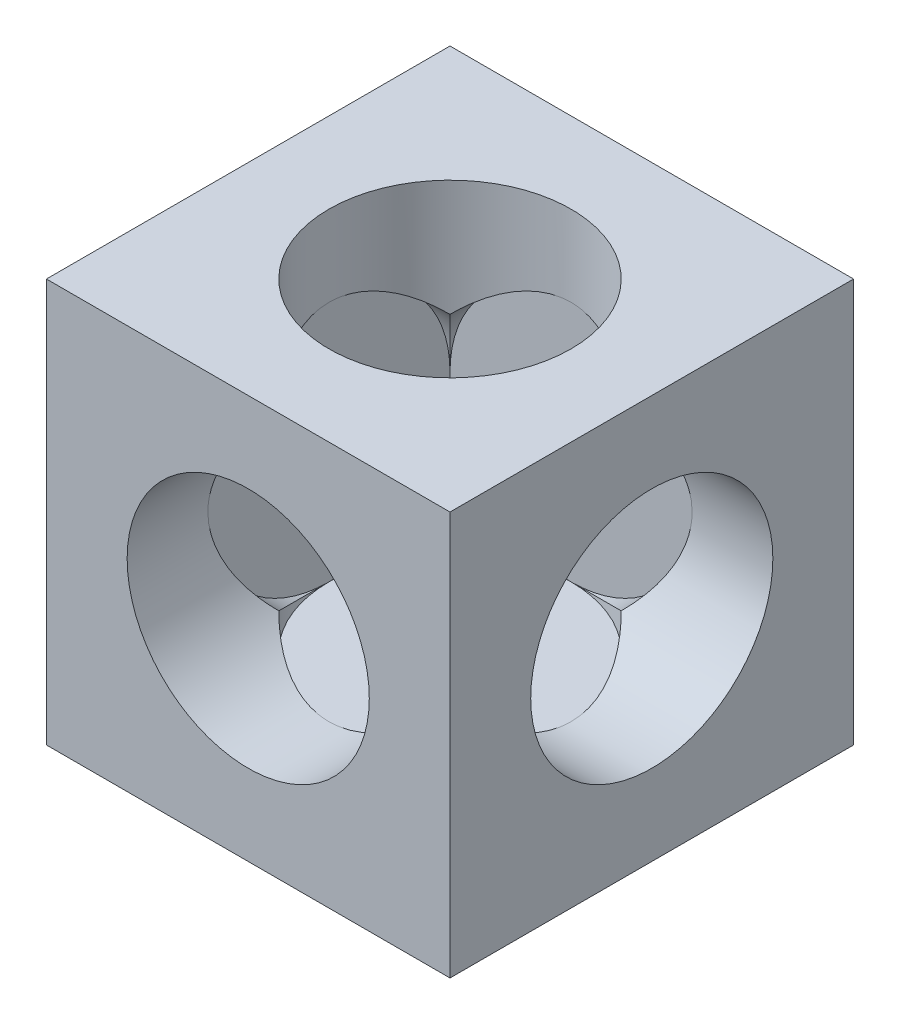
ISO-10303-21;
HEADER;
FILE_DESCRIPTION(('STEP AP214'),'2;1');
FILE_NAME('part.step','',(''),(''),'','','');
FILE_SCHEMA(('AUTOMOTIVE_DESIGN { 1 0 10303 214 1 1 1 1 }'));
ENDSEC;
DATA;
#1=APPLICATION_CONTEXT('core data for automotive mechanical design processes');
#2=APPLICATION_PROTOCOL_DEFINITION('international standard','automotive_design',2000,#1);
#3=PRODUCT_CONTEXT('',#1,'mechanical');
#4=PRODUCT('Part','Part','',(#3));
#5=PRODUCT_RELATED_PRODUCT_CATEGORY('part','',(#4));
#6=PRODUCT_DEFINITION_FORMATION('','',#4);
#7=PRODUCT_DEFINITION_CONTEXT('part definition',#1,'design');
#8=PRODUCT_DEFINITION('design','',#6,#7);
#9=PRODUCT_DEFINITION_SHAPE('','',#8);
#10=(LENGTH_UNIT() NAMED_UNIT(*) SI_UNIT(.MILLI.,.METRE.));
#11=(NAMED_UNIT(*) PLANE_ANGLE_UNIT() SI_UNIT($,.RADIAN.));
#12=(NAMED_UNIT(*) SI_UNIT($,.STERADIAN.) SOLID_ANGLE_UNIT());
#13=UNCERTAINTY_MEASURE_WITH_UNIT(LENGTH_MEASURE(1.E-05),#10,'distance_accuracy_value','');
#14=(GEOMETRIC_REPRESENTATION_CONTEXT(3) GLOBAL_UNCERTAINTY_ASSIGNED_CONTEXT((#13)) GLOBAL_UNIT_ASSIGNED_CONTEXT((#10,
#11,#12)) REPRESENTATION_CONTEXT('',''));
#15=CARTESIAN_POINT('',(0.,0.,0.));
#16=DIRECTION('',(0.,0.,1.));
#17=DIRECTION('',(1.,0.,0.));
#18=AXIS2_PLACEMENT_3D('',#15,#16,#17);
#19=CARTESIAN_POINT('',(0.,0.,2.));
#20=DIRECTION('',(0.,0.,1.));
#21=DIRECTION('',(1.,0.,0.));
#22=AXIS2_PLACEMENT_3D('',#19,#20,#21);
#23=CYLINDRICAL_SURFACE('',#22,3.);
#24=CARTESIAN_POINT('',(0.,0.,2.));
#25=DIRECTION('',(0.,0.,1.));
#26=DIRECTION('',(1.,0.,0.));
#27=AXIS2_PLACEMENT_3D('',#24,#25,#26);
#28=CIRCLE('',#27,3.);
#29=CARTESIAN_POINT('',(0.,-3.,2.));
#30=VERTEX_POINT('',#29);
#31=CARTESIAN_POINT('',(3.,0.,2.));
#32=VERTEX_POINT('',#31);
#33=EDGE_CURVE('E187',#30,#32,#28,.T.);
#34=ORIENTED_EDGE('',*,*,#33,.F.);
#35=CARTESIAN_POINT('',(0.,0.,5.));
#36=DIRECTION('',(0.,-0.707106781186547,0.707106781186547));
#37=DIRECTION('',(0.,0.707106781186547,0.707106781186547));
#38=AXIS2_PLACEMENT_3D('',#35,#36,#37);
#39=ELLIPSE('',#38,4.24264068711928,3.);
#40=CARTESIAN_POINT('',(2.12132034355964,-2.12132034355964,2.87867965644036));
#41=VERTEX_POINT('',#40);
#42=EDGE_CURVE('E259',#30,#41,#39,.T.);
#43=ORIENTED_EDGE('',*,*,#42,.T.);
#44=CARTESIAN_POINT('',(0.,0.,5.));
#45=DIRECTION('',(0.707106781186547,0.,0.707106781186547));
#46=DIRECTION('',(-0.707106781186547,0.,0.707106781186547));
#47=AXIS2_PLACEMENT_3D('',#44,#45,#46);
#48=ELLIPSE('',#47,4.24264068711929,3.);
#49=EDGE_CURVE('E41',#41,#32,#48,.T.);
#50=ORIENTED_EDGE('',*,*,#49,.T.);
#51=EDGE_LOOP('',(#34,#43,#50));
#52=FACE_BOUND('',#51,.T.);
#53=ADVANCED_FACE('F32',(#52),#23,.F.);
#54=CARTESIAN_POINT('',(2.12132034355964,2.12132034355964,2.87867965644036));
#55=VERTEX_POINT('',#54);
#56=EDGE_CURVE('E36',#32,#55,#48,.T.);
#57=ORIENTED_EDGE('',*,*,#56,.T.);
#58=CARTESIAN_POINT('',(0.,0.,5.));
#59=DIRECTION('',(0.,0.707106781186547,0.707106781186547));
#60=DIRECTION('',(0.,-0.707106781186547,0.707106781186547));
#61=AXIS2_PLACEMENT_3D('',#58,#59,#60);
#62=ELLIPSE('',#61,4.24264068711928,3.);
#63=CARTESIAN_POINT('',(0.,3.,2.));
#64=VERTEX_POINT('',#63);
#65=EDGE_CURVE('E133',#55,#64,#62,.T.);
#66=ORIENTED_EDGE('',*,*,#65,.T.);
#67=EDGE_CURVE('E190',#32,#64,#28,.T.);
#68=ORIENTED_EDGE('',*,*,#67,.F.);
#69=EDGE_LOOP('',(#57,#66,#68));
#70=FACE_BOUND('',#69,.T.);
#71=ADVANCED_FACE('F265',(#70),#23,.F.);
#72=CARTESIAN_POINT('',(0.,-5.,5.));
#73=DIRECTION('',(0.,-1.,0.));
#74=DIRECTION('',(0.,0.,-1.));
#75=AXIS2_PLACEMENT_3D('',#72,#73,#74);
#76=CYLINDRICAL_SURFACE('',#75,1.25);
#77=CARTESIAN_POINT('',(0.,-5.,5.));
#78=DIRECTION('',(0.,-1.,0.));
#79=DIRECTION('',(0.,0.,-1.));
#80=AXIS2_PLACEMENT_3D('',#77,#78,#79);
#81=CIRCLE('',#80,1.25);
#82=CARTESIAN_POINT('',(0.,-5.,3.75));
#83=VERTEX_POINT('',#82);
#84=EDGE_CURVE('E196',#83,#83,#81,.T.);
#85=ORIENTED_EDGE('',*,*,#84,.T.);
#86=EDGE_LOOP('',(#85));
#87=FACE_BOUND('',#86,.T.);
#88=CARTESIAN_POINT('',(0.,-3.,5.));
#89=DIRECTION('',(0.,1.,0.));
#90=DIRECTION('',(-1.,0.,0.));
#91=AXIS2_PLACEMENT_3D('',#88,#89,#90);
#92=CIRCLE('',#91,1.25);
#93=CARTESIAN_POINT('',(-1.25,-3.,5.));
#94=VERTEX_POINT('',#93);
#95=EDGE_CURVE('E154',#94,#94,#92,.F.);
#96=ORIENTED_EDGE('',*,*,#95,.F.);
#97=EDGE_LOOP('',(#96));
#98=FACE_BOUND('',#97,.T.);
#99=ADVANCED_FACE('F317',(#87,#98),#76,.F.);
#100=CARTESIAN_POINT('',(-3.,0.,5.));
#101=DIRECTION('',(1.,0.,0.));
#102=DIRECTION('',(0.,0.,-1.));
#103=AXIS2_PLACEMENT_3D('',#100,#101,#102);
#104=CYLINDRICAL_SURFACE('',#103,3.);
#105=CARTESIAN_POINT('',(-3.,0.,5.));
#106=DIRECTION('',(1.,0.,0.));
#107=DIRECTION('',(0.,0.,-1.));
#108=AXIS2_PLACEMENT_3D('',#105,#106,#107);
#109=CIRCLE('',#108,3.);
#110=CARTESIAN_POINT('',(-3.,-3.,5.));
#111=VERTEX_POINT('',#110);
#112=CARTESIAN_POINT('',(-3.,0.,2.));
#113=VERTEX_POINT('',#112);
#114=EDGE_CURVE('E164',#111,#113,#109,.T.);
#115=ORIENTED_EDGE('',*,*,#114,.F.);
#116=CARTESIAN_POINT('',(0.,0.,5.));
#117=DIRECTION('',(0.707106781186547,-0.707106781186547,0.));
#118=DIRECTION('',(0.707106781186547,0.707106781186548,0.));
#119=AXIS2_PLACEMENT_3D('',#116,#117,#118);
#120=ELLIPSE('',#119,4.24264068711928,3.);
#121=CARTESIAN_POINT('',(-2.12132034355964,-2.12132034355964,2.87867965644036));
#122=VERTEX_POINT('',#121);
#123=EDGE_CURVE('E124',#111,#122,#120,.T.);
#124=ORIENTED_EDGE('',*,*,#123,.T.);
#125=CARTESIAN_POINT('',(0.,0.,5.));
#126=DIRECTION('',(-0.707106781186547,0.,0.707106781186547));
#127=DIRECTION('',(0.707106781186547,0.,0.707106781186547));
#128=AXIS2_PLACEMENT_3D('',#125,#126,#127);
#129=ELLIPSE('',#128,4.24264068711929,3.);
#130=EDGE_CURVE('E166',#113,#122,#129,.T.);
#131=ORIENTED_EDGE('',*,*,#130,.F.);
#132=EDGE_LOOP('',(#115,#124,#131));
#133=FACE_BOUND('',#132,.T.);
#134=ADVANCED_FACE('F165',(#133),#104,.F.);
#135=CARTESIAN_POINT('',(-2.12132034355964,2.12132034355964,2.87867965644036));
#136=VERTEX_POINT('',#135);
#137=EDGE_CURVE('E237',#136,#113,#129,.T.);
#138=ORIENTED_EDGE('',*,*,#137,.F.);
#139=CARTESIAN_POINT('',(0.,0.,5.));
#140=DIRECTION('',(0.707106781186547,0.707106781186548,0.));
#141=DIRECTION('',(0.707106781186547,-0.707106781186547,0.));
#142=AXIS2_PLACEMENT_3D('',#139,#140,#141);
#143=ELLIPSE('',#142,4.24264068711929,3.);
#144=CARTESIAN_POINT('',(-3.,3.,5.));
#145=VERTEX_POINT('',#144);
#146=EDGE_CURVE('E271',#136,#145,#143,.T.);
#147=ORIENTED_EDGE('',*,*,#146,.T.);
#148=EDGE_CURVE('E173',#113,#145,#109,.T.);
#149=ORIENTED_EDGE('',*,*,#148,.F.);
#150=EDGE_LOOP('',(#138,#147,#149));
#151=FACE_BOUND('',#150,.T.);
#152=ADVANCED_FACE('F295',(#151),#104,.F.);
#153=CARTESIAN_POINT('',(5.,0.,5.));
#154=DIRECTION('',(1.,0.,0.));
#155=DIRECTION('',(0.,0.,-1.));
#156=AXIS2_PLACEMENT_3D('',#153,#154,#155);
#157=CYLINDRICAL_SURFACE('',#156,1.25);
#158=CARTESIAN_POINT('',(-5.,0.,5.));
#159=DIRECTION('',(1.,0.,0.));
#160=DIRECTION('',(0.,0.,-1.));
#161=AXIS2_PLACEMENT_3D('',#158,#159,#160);
#162=CIRCLE('',#161,1.25);
#163=CARTESIAN_POINT('',(-5.,0.,3.75));
#164=VERTEX_POINT('',#163);
#165=EDGE_CURVE('E199',#164,#164,#162,.T.);
#166=ORIENTED_EDGE('',*,*,#165,.F.);
#167=EDGE_LOOP('',(#166));
#168=FACE_BOUND('',#167,.T.);
#169=CARTESIAN_POINT('',(-3.,0.,5.));
#170=DIRECTION('',(1.,0.,0.));
#171=DIRECTION('',(0.,0.,-1.));
#172=AXIS2_PLACEMENT_3D('',#169,#170,#171);
#173=CIRCLE('',#172,1.25);
#174=CARTESIAN_POINT('',(-3.,0.,3.75));
#175=VERTEX_POINT('',#174);
#176=EDGE_CURVE('E180',#175,#175,#173,.F.);
#177=ORIENTED_EDGE('',*,*,#176,.F.);
#178=EDGE_LOOP('',(#177));
#179=FACE_BOUND('',#178,.T.);
#180=ADVANCED_FACE('F337',(#168,#179),#157,.F.);
#181=ORIENTED_EDGE('',*,*,#130,.T.);
#182=EDGE_CURVE('E50',#122,#30,#39,.T.);
#183=ORIENTED_EDGE('',*,*,#182,.T.);
#184=EDGE_CURVE('E194',#113,#30,#28,.T.);
#185=ORIENTED_EDGE('',*,*,#184,.F.);
#186=EDGE_LOOP('',(#181,#183,#185));
#187=FACE_BOUND('',#186,.T.);
#188=ADVANCED_FACE('F270',(#187),#23,.F.);
#189=EDGE_CURVE('E193',#64,#113,#28,.T.);
#190=ORIENTED_EDGE('',*,*,#189,.F.);
#191=EDGE_CURVE('E162',#64,#136,#62,.T.);
#192=ORIENTED_EDGE('',*,*,#191,.T.);
#193=ORIENTED_EDGE('',*,*,#137,.T.);
#194=EDGE_LOOP('',(#190,#192,#193));
#195=FACE_BOUND('',#194,.T.);
#196=ADVANCED_FACE('F293',(#195),#23,.F.);
#197=CARTESIAN_POINT('',(0.,0.,10.));
#198=DIRECTION('',(0.,0.,1.));
#199=DIRECTION('',(1.,0.,0.));
#200=AXIS2_PLACEMENT_3D('',#197,#198,#199);
#201=CYLINDRICAL_SURFACE('',#200,1.25);
#202=CARTESIAN_POINT('',(0.,0.,0.));
#203=DIRECTION('',(0.,0.,1.));
#204=DIRECTION('',(1.,0.,0.));
#205=AXIS2_PLACEMENT_3D('',#202,#203,#204);
#206=CIRCLE('',#205,1.25);
#207=CARTESIAN_POINT('',(1.25,0.,0.));
#208=VERTEX_POINT('',#207);
#209=EDGE_CURVE('E202',#208,#208,#206,.T.);
#210=ORIENTED_EDGE('',*,*,#209,.F.);
#211=EDGE_LOOP('',(#210));
#212=FACE_BOUND('',#211,.T.);
#213=CARTESIAN_POINT('',(0.,0.,2.));
#214=DIRECTION('',(0.,0.,1.));
#215=DIRECTION('',(1.,0.,0.));
#216=AXIS2_PLACEMENT_3D('',#213,#214,#215);
#217=CIRCLE('',#216,1.25);
#218=CARTESIAN_POINT('',(1.25,0.,2.));
#219=VERTEX_POINT('',#218);
#220=EDGE_CURVE('E192',#219,#219,#217,.F.);
#221=ORIENTED_EDGE('',*,*,#220,.F.);
#222=EDGE_LOOP('',(#221));
#223=FACE_BOUND('',#222,.T.);
#224=ADVANCED_FACE('F330',(#212,#223),#201,.F.);
#225=CARTESIAN_POINT('',(-5.,-5.,10.));
#226=DIRECTION('',(1.,0.,0.));
#227=DIRECTION('',(0.,0.,-1.));
#228=AXIS2_PLACEMENT_3D('',#225,#226,#227);
#229=PLANE('',#228);
#230=ORIENTED_EDGE('',*,*,#165,.T.);
#231=EDGE_LOOP('',(#230));
#232=FACE_BOUND('',#231,.T.);
#233=DIRECTION('',(0.,-1.,0.));
#234=VECTOR('',#233,1.);
#235=CARTESIAN_POINT('',(-5.,-5.,0.));
#236=LINE('',#235,#234);
#237=CARTESIAN_POINT('',(-5.,5.,0.));
#238=VERTEX_POINT('',#237);
#239=CARTESIAN_POINT('',(-5.,-5.,0.));
#240=VERTEX_POINT('',#239);
#241=EDGE_CURVE('E205',#238,#240,#236,.T.);
#242=ORIENTED_EDGE('',*,*,#241,.T.);
#243=DIRECTION('',(0.,0.,-1.));
#244=VECTOR('',#243,1.);
#245=CARTESIAN_POINT('',(-5.,-5.,10.));
#246=LINE('',#245,#244);
#247=CARTESIAN_POINT('',(-5.,-5.,10.));
#248=VERTEX_POINT('',#247);
#249=EDGE_CURVE('E232',#248,#240,#246,.T.);
#250=ORIENTED_EDGE('',*,*,#249,.F.);
#251=DIRECTION('',(0.,-1.,0.));
#252=VECTOR('',#251,1.);
#253=CARTESIAN_POINT('',(-5.,-5.,10.));
#254=LINE('',#253,#252);
#255=CARTESIAN_POINT('',(-5.,5.,10.));
#256=VERTEX_POINT('',#255);
#257=EDGE_CURVE('E206',#256,#248,#254,.T.);
#258=ORIENTED_EDGE('',*,*,#257,.F.);
#259=DIRECTION('',(0.,0.,-1.));
#260=VECTOR('',#259,1.);
#261=CARTESIAN_POINT('',(-5.,5.,10.));
#262=LINE('',#261,#260);
#263=EDGE_CURVE('E216',#256,#238,#262,.T.);
#264=ORIENTED_EDGE('',*,*,#263,.T.);
#265=EDGE_LOOP('',(#242,#250,#258,#264));
#266=FACE_BOUND('',#265,.T.);
#267=ADVANCED_FACE('F34',(#232,#266),#229,.F.);
#268=CARTESIAN_POINT('',(5.,-5.,10.));
#269=DIRECTION('',(0.,1.,0.));
#270=DIRECTION('',(-1.,0.,0.));
#271=AXIS2_PLACEMENT_3D('',#268,#269,#270);
#272=PLANE('',#271);
#273=ORIENTED_EDGE('',*,*,#84,.F.);
#274=EDGE_LOOP('',(#273));
#275=FACE_BOUND('',#274,.T.);
#276=DIRECTION('',(1.,0.,0.));
#277=VECTOR('',#276,1.);
#278=CARTESIAN_POINT('',(5.,-5.,0.));
#279=LINE('',#278,#277);
#280=CARTESIAN_POINT('',(5.,-5.,0.));
#281=VERTEX_POINT('',#280);
#282=EDGE_CURVE('E219',#240,#281,#279,.T.);
#283=ORIENTED_EDGE('',*,*,#282,.T.);
#284=DIRECTION('',(0.,0.,-1.));
#285=VECTOR('',#284,1.);
#286=CARTESIAN_POINT('',(5.,-5.,10.));
#287=LINE('',#286,#285);
#288=CARTESIAN_POINT('',(5.,-5.,10.));
#289=VERTEX_POINT('',#288);
#290=EDGE_CURVE('E229',#289,#281,#287,.T.);
#291=ORIENTED_EDGE('',*,*,#290,.F.);
#292=DIRECTION('',(1.,0.,0.));
#293=VECTOR('',#292,1.);
#294=CARTESIAN_POINT('',(5.,-5.,10.));
#295=LINE('',#294,#293);
#296=EDGE_CURVE('E209',#248,#289,#295,.T.);
#297=ORIENTED_EDGE('',*,*,#296,.F.);
#298=ORIENTED_EDGE('',*,*,#249,.T.);
#299=EDGE_LOOP('',(#283,#291,#297,#298));
#300=FACE_BOUND('',#299,.T.);
#301=ADVANCED_FACE('F362',(#275,#300),#272,.F.);
#302=CARTESIAN_POINT('',(5.,-5.,10.));
#303=DIRECTION('',(-1.,0.,0.));
#304=DIRECTION('',(0.,0.,1.));
#305=AXIS2_PLACEMENT_3D('',#302,#303,#304);
#306=PLANE('',#305);
#307=CARTESIAN_POINT('',(5.,0.,5.));
#308=DIRECTION('',(1.,0.,0.));
#309=DIRECTION('',(0.,0.,-1.));
#310=AXIS2_PLACEMENT_3D('',#307,#308,#309);
#311=CIRCLE('',#310,3.);
#312=CARTESIAN_POINT('',(5.,0.,2.));
#313=VERTEX_POINT('',#312);
#314=EDGE_CURVE('E170',#313,#313,#311,.T.);
#315=ORIENTED_EDGE('',*,*,#314,.F.);
#316=EDGE_LOOP('',(#315));
#317=FACE_BOUND('',#316,.T.);
#318=DIRECTION('',(0.,1.,0.));
#319=VECTOR('',#318,1.);
#320=CARTESIAN_POINT('',(5.,-5.,0.));
#321=LINE('',#320,#319);
#322=CARTESIAN_POINT('',(5.,5.,0.));
#323=VERTEX_POINT('',#322);
#324=EDGE_CURVE('E221',#281,#323,#321,.T.);
#325=ORIENTED_EDGE('',*,*,#324,.T.);
#326=DIRECTION('',(0.,0.,-1.));
#327=VECTOR('',#326,1.);
#328=CARTESIAN_POINT('',(5.,5.,10.));
#329=LINE('',#328,#327);
#330=CARTESIAN_POINT('',(5.,5.,10.));
#331=VERTEX_POINT('',#330);
#332=EDGE_CURVE('E226',#331,#323,#329,.T.);
#333=ORIENTED_EDGE('',*,*,#332,.F.);
#334=DIRECTION('',(0.,1.,0.));
#335=VECTOR('',#334,1.);
#336=CARTESIAN_POINT('',(5.,-5.,10.));
#337=LINE('',#336,#335);
#338=EDGE_CURVE('E212',#289,#331,#337,.T.);
#339=ORIENTED_EDGE('',*,*,#338,.F.);
#340=ORIENTED_EDGE('',*,*,#290,.T.);
#341=EDGE_LOOP('',(#325,#333,#339,#340));
#342=FACE_BOUND('',#341,.T.);
#343=ADVANCED_FACE('F359',(#317,#342),#306,.F.);
#344=CARTESIAN_POINT('',(5.,5.,10.));
#345=DIRECTION('',(0.,-1.,0.));
#346=DIRECTION('',(1.,0.,0.));
#347=AXIS2_PLACEMENT_3D('',#344,#345,#346);
#348=PLANE('',#347);
#349=CARTESIAN_POINT('',(0.,5.,5.));
#350=DIRECTION('',(0.,1.,0.));
#351=DIRECTION('',(-1.,0.,0.));
#352=AXIS2_PLACEMENT_3D('',#349,#350,#351);
#353=CIRCLE('',#352,3.);
#354=CARTESIAN_POINT('',(-3.,5.,5.));
#355=VERTEX_POINT('',#354);
#356=EDGE_CURVE('E146',#355,#355,#353,.T.);
#357=ORIENTED_EDGE('',*,*,#356,.F.);
#358=EDGE_LOOP('',(#357));
#359=FACE_BOUND('',#358,.T.);
#360=DIRECTION('',(-1.,0.,0.));
#361=VECTOR('',#360,1.);
#362=CARTESIAN_POINT('',(5.,5.,0.));
#363=LINE('',#362,#361);
#364=EDGE_CURVE('E210',#323,#238,#363,.T.);
#365=ORIENTED_EDGE('',*,*,#364,.T.);
#366=ORIENTED_EDGE('',*,*,#263,.F.);
#367=DIRECTION('',(-1.,0.,0.));
#368=VECTOR('',#367,1.);
#369=CARTESIAN_POINT('',(5.,5.,10.));
#370=LINE('',#369,#368);
#371=EDGE_CURVE('E214',#331,#256,#370,.T.);
#372=ORIENTED_EDGE('',*,*,#371,.F.);
#373=ORIENTED_EDGE('',*,*,#332,.T.);
#374=EDGE_LOOP('',(#365,#366,#372,#373));
#375=FACE_BOUND('',#374,.T.);
#376=ADVANCED_FACE('F352',(#359,#375),#348,.F.);
#377=CARTESIAN_POINT('',(0.,0.,10.));
#378=DIRECTION('',(0.,0.,1.));
#379=DIRECTION('',(1.,0.,0.));
#380=AXIS2_PLACEMENT_3D('',#377,#378,#379);
#381=PLANE('',#380);
#382=CARTESIAN_POINT('',(0.,0.,10.));
#383=DIRECTION('',(0.,0.,1.));
#384=DIRECTION('',(1.,0.,0.));
#385=AXIS2_PLACEMENT_3D('',#382,#383,#384);
#386=CIRCLE('',#385,3.);
#387=CARTESIAN_POINT('',(3.,0.,10.));
#388=VERTEX_POINT('',#387);
#389=EDGE_CURVE('E182',#388,#388,#386,.T.);
#390=ORIENTED_EDGE('',*,*,#389,.F.);
#391=EDGE_LOOP('',(#390));
#392=FACE_BOUND('',#391,.T.);
#393=ORIENTED_EDGE('',*,*,#257,.T.);
#394=ORIENTED_EDGE('',*,*,#296,.T.);
#395=ORIENTED_EDGE('',*,*,#338,.T.);
#396=ORIENTED_EDGE('',*,*,#371,.T.);
#397=EDGE_LOOP('',(#393,#394,#395,#396));
#398=FACE_BOUND('',#397,.T.);
#399=ADVANCED_FACE('F349',(#392,#398),#381,.T.);
#400=CARTESIAN_POINT('',(0.,0.,0.));
#401=DIRECTION('',(0.,0.,1.));
#402=DIRECTION('',(1.,0.,0.));
#403=AXIS2_PLACEMENT_3D('',#400,#401,#402);
#404=PLANE('',#403);
#405=ORIENTED_EDGE('',*,*,#209,.T.);
#406=EDGE_LOOP('',(#405));
#407=FACE_BOUND('',#406,.T.);
#408=ORIENTED_EDGE('',*,*,#241,.F.);
#409=ORIENTED_EDGE('',*,*,#364,.F.);
#410=ORIENTED_EDGE('',*,*,#324,.F.);
#411=ORIENTED_EDGE('',*,*,#282,.F.);
#412=EDGE_LOOP('',(#408,#409,#410,#411));
#413=FACE_BOUND('',#412,.T.);
#414=ADVANCED_FACE('F327',(#407,#413),#404,.F.);
#415=CARTESIAN_POINT('',(0.,0.,2.));
#416=DIRECTION('',(0.,0.,1.));
#417=DIRECTION('',(1.,0.,0.));
#418=AXIS2_PLACEMENT_3D('',#415,#416,#417);
#419=PLANE('',#418);
#420=ORIENTED_EDGE('',*,*,#220,.T.);
#421=EDGE_LOOP('',(#420));
#422=FACE_BOUND('',#421,.T.);
#423=ORIENTED_EDGE('',*,*,#184,.T.);
#424=ORIENTED_EDGE('',*,*,#33,.T.);
#425=ORIENTED_EDGE('',*,*,#67,.T.);
#426=ORIENTED_EDGE('',*,*,#189,.T.);
#427=EDGE_LOOP('',(#423,#424,#425,#426));
#428=FACE_BOUND('',#427,.T.);
#429=ADVANCED_FACE('F267',(#422,#428),#419,.T.);
#430=CARTESIAN_POINT('',(0.,0.,5.));
#431=DIRECTION('',(-0.707106781186547,0.,0.707106781186547));
#432=DIRECTION('',(0.707106781186547,0.,0.707106781186547));
#433=AXIS2_PLACEMENT_3D('',#430,#431,#432);
#434=ELLIPSE('',#433,4.24264068711929,3.);
#435=CARTESIAN_POINT('',(2.12132034355964,2.12132034355964,7.12132034355964));
#436=VERTEX_POINT('',#435);
#437=CARTESIAN_POINT('',(2.12132034355964,-2.12132034355964,7.12132034355964));
#438=VERTEX_POINT('',#437);
#439=EDGE_CURVE('E239',#436,#438,#434,.F.);
#440=ORIENTED_EDGE('',*,*,#439,.T.);
#441=CARTESIAN_POINT('',(0.,0.,5.));
#442=DIRECTION('',(0.,0.707106781186547,0.707106781186547));
#443=DIRECTION('',(0.,-0.707106781186547,0.707106781186547));
#444=AXIS2_PLACEMENT_3D('',#441,#442,#443);
#445=ELLIPSE('',#444,4.24264068711928,3.);
#446=CARTESIAN_POINT('',(0.,-3.,8.));
#447=VERTEX_POINT('',#446);
#448=EDGE_CURVE('E281',#438,#447,#445,.F.);
#449=ORIENTED_EDGE('',*,*,#448,.T.);
#450=CARTESIAN_POINT('',(-2.12132034355964,-2.12132034355964,7.12132034355964));
#451=VERTEX_POINT('',#450);
#452=EDGE_CURVE('E152',#447,#451,#445,.F.);
#453=ORIENTED_EDGE('',*,*,#452,.T.);
#454=CARTESIAN_POINT('',(0.,0.,5.));
#455=DIRECTION('',(0.707106781186547,0.,0.707106781186547));
#456=DIRECTION('',(-0.707106781186547,0.,0.707106781186547));
#457=AXIS2_PLACEMENT_3D('',#454,#455,#456);
#458=ELLIPSE('',#457,4.24264068711929,3.);
#459=CARTESIAN_POINT('',(-3.,0.,8.));
#460=VERTEX_POINT('',#459);
#461=EDGE_CURVE('E11',#451,#460,#458,.F.);
#462=ORIENTED_EDGE('',*,*,#461,.T.);
#463=CARTESIAN_POINT('',(-2.12132034355964,2.12132034355964,7.12132034355964));
#464=VERTEX_POINT('',#463);
#465=EDGE_CURVE('E43',#460,#464,#458,.F.);
#466=ORIENTED_EDGE('',*,*,#465,.T.);
#467=CARTESIAN_POINT('',(0.,0.,5.));
#468=DIRECTION('',(0.,-0.707106781186547,0.707106781186547));
#469=DIRECTION('',(0.,0.707106781186547,0.707106781186547));
#470=AXIS2_PLACEMENT_3D('',#467,#468,#469);
#471=ELLIPSE('',#470,4.24264068711928,3.);
#472=EDGE_CURVE('E58',#464,#436,#471,.F.);
#473=ORIENTED_EDGE('',*,*,#472,.T.);
#474=EDGE_LOOP('',(#440,#449,#453,#462,#466,#473));
#475=FACE_BOUND('',#474,.T.);
#476=ORIENTED_EDGE('',*,*,#389,.T.);
#477=EDGE_LOOP('',(#476));
#478=FACE_BOUND('',#477,.T.);
#479=ADVANCED_FACE('F282',(#475,#478),#23,.F.);
#480=ORIENTED_EDGE('',*,*,#314,.T.);
#481=EDGE_LOOP('',(#480));
#482=FACE_BOUND('',#481,.T.);
#483=ORIENTED_EDGE('',*,*,#49,.F.);
#484=CARTESIAN_POINT('',(0.,0.,5.));
#485=DIRECTION('',(0.707106781186547,0.707106781186548,0.));
#486=DIRECTION('',(0.707106781186547,-0.707106781186547,0.));
#487=AXIS2_PLACEMENT_3D('',#484,#485,#486);
#488=ELLIPSE('',#487,4.24264068711929,3.);
#489=CARTESIAN_POINT('',(3.,-3.,5.));
#490=VERTEX_POINT('',#489);
#491=EDGE_CURVE('E277',#41,#490,#488,.F.);
#492=ORIENTED_EDGE('',*,*,#491,.T.);
#493=EDGE_CURVE('E279',#490,#438,#488,.F.);
#494=ORIENTED_EDGE('',*,*,#493,.T.);
#495=ORIENTED_EDGE('',*,*,#439,.F.);
#496=CARTESIAN_POINT('',(0.,0.,5.));
#497=DIRECTION('',(0.707106781186547,-0.707106781186547,0.));
#498=DIRECTION('',(0.707106781186547,0.707106781186548,0.));
#499=AXIS2_PLACEMENT_3D('',#496,#497,#498);
#500=ELLIPSE('',#499,4.24264068711928,3.);
#501=EDGE_CURVE('E264',#436,#55,#500,.F.);
#502=ORIENTED_EDGE('',*,*,#501,.T.);
#503=ORIENTED_EDGE('',*,*,#56,.F.);
#504=EDGE_LOOP('',(#483,#492,#494,#495,#502,#503));
#505=FACE_BOUND('',#504,.T.);
#506=ADVANCED_FACE('F263',(#482,#505),#104,.F.);
#507=ORIENTED_EDGE('',*,*,#461,.F.);
#508=EDGE_CURVE('E135',#451,#111,#120,.T.);
#509=ORIENTED_EDGE('',*,*,#508,.T.);
#510=EDGE_CURVE('E161',#460,#111,#109,.T.);
#511=ORIENTED_EDGE('',*,*,#510,.F.);
#512=EDGE_LOOP('',(#507,#509,#511));
#513=FACE_BOUND('',#512,.T.);
#514=ADVANCED_FACE('F159',(#513),#104,.F.);
#515=EDGE_CURVE('E172',#145,#460,#109,.T.);
#516=ORIENTED_EDGE('',*,*,#515,.F.);
#517=EDGE_CURVE('E275',#145,#464,#143,.T.);
#518=ORIENTED_EDGE('',*,*,#517,.T.);
#519=ORIENTED_EDGE('',*,*,#465,.F.);
#520=EDGE_LOOP('',(#516,#518,#519));
#521=FACE_BOUND('',#520,.T.);
#522=ADVANCED_FACE('F297',(#521),#104,.F.);
#523=CARTESIAN_POINT('',(-3.,0.,5.));
#524=DIRECTION('',(1.,0.,0.));
#525=DIRECTION('',(0.,0.,-1.));
#526=AXIS2_PLACEMENT_3D('',#523,#524,#525);
#527=PLANE('',#526);
#528=ORIENTED_EDGE('',*,*,#176,.T.);
#529=EDGE_LOOP('',(#528));
#530=FACE_BOUND('',#529,.T.);
#531=ORIENTED_EDGE('',*,*,#510,.T.);
#532=ORIENTED_EDGE('',*,*,#114,.T.);
#533=ORIENTED_EDGE('',*,*,#148,.T.);
#534=ORIENTED_EDGE('',*,*,#515,.T.);
#535=EDGE_LOOP('',(#531,#532,#533,#534));
#536=FACE_BOUND('',#535,.T.);
#537=ADVANCED_FACE('F175',(#530,#536),#527,.T.);
#538=CARTESIAN_POINT('',(0.,-3.,5.));
#539=DIRECTION('',(0.,1.,0.));
#540=DIRECTION('',(-1.,0.,0.));
#541=AXIS2_PLACEMENT_3D('',#538,#539,#540);
#542=CYLINDRICAL_SURFACE('',#541,3.);
#543=ORIENTED_EDGE('',*,*,#356,.T.);
#544=EDGE_LOOP('',(#543));
#545=FACE_BOUND('',#544,.T.);
#546=ORIENTED_EDGE('',*,*,#65,.F.);
#547=ORIENTED_EDGE('',*,*,#501,.F.);
#548=ORIENTED_EDGE('',*,*,#472,.F.);
#549=ORIENTED_EDGE('',*,*,#517,.F.);
#550=ORIENTED_EDGE('',*,*,#146,.F.);
#551=ORIENTED_EDGE('',*,*,#191,.F.);
#552=EDGE_LOOP('',(#546,#547,#548,#549,#550,#551));
#553=FACE_BOUND('',#552,.T.);
#554=ADVANCED_FACE('F298',(#545,#553),#542,.F.);
#555=CARTESIAN_POINT('',(0.,-3.,5.));
#556=DIRECTION('',(0.,1.,0.));
#557=DIRECTION('',(-1.,0.,0.));
#558=AXIS2_PLACEMENT_3D('',#555,#556,#557);
#559=CIRCLE('',#558,3.);
#560=EDGE_CURVE('E145',#490,#30,#559,.T.);
#561=ORIENTED_EDGE('',*,*,#560,.F.);
#562=ORIENTED_EDGE('',*,*,#491,.F.);
#563=ORIENTED_EDGE('',*,*,#42,.F.);
#564=EDGE_LOOP('',(#561,#562,#563));
#565=FACE_BOUND('',#564,.T.);
#566=ADVANCED_FACE('F300',(#565),#542,.F.);
#567=EDGE_CURVE('E155',#447,#490,#559,.T.);
#568=ORIENTED_EDGE('',*,*,#567,.F.);
#569=ORIENTED_EDGE('',*,*,#448,.F.);
#570=ORIENTED_EDGE('',*,*,#493,.F.);
#571=EDGE_LOOP('',(#568,#569,#570));
#572=FACE_BOUND('',#571,.T.);
#573=ADVANCED_FACE('F285',(#572),#542,.F.);
#574=EDGE_CURVE('E142',#111,#447,#559,.T.);
#575=ORIENTED_EDGE('',*,*,#574,.F.);
#576=ORIENTED_EDGE('',*,*,#508,.F.);
#577=ORIENTED_EDGE('',*,*,#452,.F.);
#578=EDGE_LOOP('',(#575,#576,#577));
#579=FACE_BOUND('',#578,.T.);
#580=ADVANCED_FACE('F150',(#579),#542,.F.);
#581=ORIENTED_EDGE('',*,*,#123,.F.);
#582=EDGE_CURVE('E127',#30,#111,#559,.T.);
#583=ORIENTED_EDGE('',*,*,#582,.F.);
#584=ORIENTED_EDGE('',*,*,#182,.F.);
#585=EDGE_LOOP('',(#581,#583,#584));
#586=FACE_BOUND('',#585,.T.);
#587=ADVANCED_FACE('F126',(#586),#542,.F.);
#588=CARTESIAN_POINT('',(0.,-3.,5.));
#589=DIRECTION('',(0.,1.,0.));
#590=DIRECTION('',(-1.,0.,0.));
#591=AXIS2_PLACEMENT_3D('',#588,#589,#590);
#592=PLANE('',#591);
#593=ORIENTED_EDGE('',*,*,#560,.T.);
#594=ORIENTED_EDGE('',*,*,#582,.T.);
#595=ORIENTED_EDGE('',*,*,#574,.T.);
#596=ORIENTED_EDGE('',*,*,#567,.T.);
#597=EDGE_LOOP('',(#593,#594,#595,#596));
#598=FACE_BOUND('',#597,.T.);
#599=ORIENTED_EDGE('',*,*,#95,.T.);
#600=EDGE_LOOP('',(#599));
#601=FACE_BOUND('',#600,.T.);
#602=ADVANCED_FACE('F139',(#598,#601),#592,.T.);
#603=CLOSED_SHELL('',(#53,#71,#99,#134,#152,#180,#188,#196,#224,#267,#301,#343,#376,#399,#414,
#429,#479,#506,#514,#522,#537,#554,#566,#573,#580,#587,#602));
#604=MANIFOLD_SOLID_BREP('B2',#603);
#605=ADVANCED_BREP_SHAPE_REPRESENTATION('',(#18,#604),#14);
#606=SHAPE_DEFINITION_REPRESENTATION(#9,#605);
ENDSEC;
END-ISO-10303-21;
